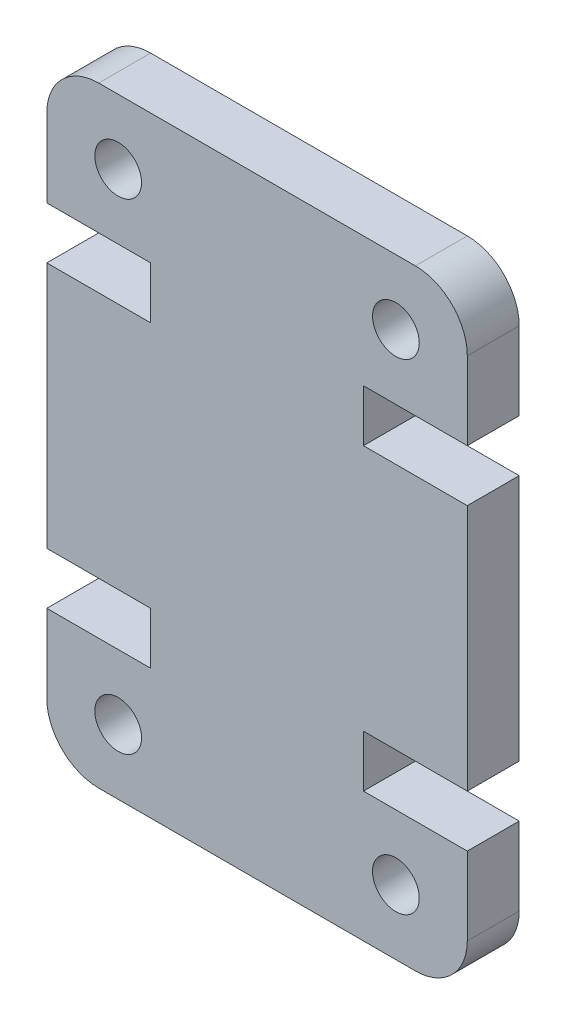
ISO-10303-21;
HEADER;
FILE_DESCRIPTION(('STEP AP214'),'2;1');
FILE_NAME('part.step','',(''),(''),'','','');
FILE_SCHEMA(('AUTOMOTIVE_DESIGN { 1 0 10303 214 1 1 1 1 }'));
ENDSEC;
DATA;
#1=APPLICATION_CONTEXT('core data for automotive mechanical design processes');
#2=APPLICATION_PROTOCOL_DEFINITION('international standard','automotive_design',2000,#1);
#3=PRODUCT_CONTEXT('',#1,'mechanical');
#4=PRODUCT('Part','Part','',(#3));
#5=PRODUCT_RELATED_PRODUCT_CATEGORY('part','',(#4));
#6=PRODUCT_DEFINITION_FORMATION('','',#4);
#7=PRODUCT_DEFINITION_CONTEXT('part definition',#1,'design');
#8=PRODUCT_DEFINITION('design','',#6,#7);
#9=PRODUCT_DEFINITION_SHAPE('','',#8);
#10=(LENGTH_UNIT() NAMED_UNIT(*) SI_UNIT(.MILLI.,.METRE.));
#11=(NAMED_UNIT(*) PLANE_ANGLE_UNIT() SI_UNIT($,.RADIAN.));
#12=(NAMED_UNIT(*) SI_UNIT($,.STERADIAN.) SOLID_ANGLE_UNIT());
#13=UNCERTAINTY_MEASURE_WITH_UNIT(LENGTH_MEASURE(1.E-05),#10,'distance_accuracy_value','');
#14=(GEOMETRIC_REPRESENTATION_CONTEXT(3) GLOBAL_UNCERTAINTY_ASSIGNED_CONTEXT((#13)) GLOBAL_UNIT_ASSIGNED_CONTEXT((#10,
#11,#12)) REPRESENTATION_CONTEXT('',''));
#15=CARTESIAN_POINT('',(0.,0.,0.));
#16=DIRECTION('',(0.,0.,1.));
#17=DIRECTION('',(1.,0.,0.));
#18=AXIS2_PLACEMENT_3D('',#15,#16,#17);
#19=CARTESIAN_POINT('',(14.2,2.,2.));
#20=DIRECTION('',(0.,0.,-1.));
#21=DIRECTION('',(-1.,0.,0.));
#22=AXIS2_PLACEMENT_3D('',#19,#20,#21);
#23=PLANE('',#22);
#24=CARTESIAN_POINT('',(13.4499999999986,21.0250000000001,2.));
#25=DIRECTION('',(0.,0.,1.));
#26=DIRECTION('',(1.,0.,0.));
#27=AXIS2_PLACEMENT_3D('',#24,#25,#26);
#28=CIRCLE('',#27,0.900000000000001);
#29=CARTESIAN_POINT('',(14.3499999999986,21.0250000000001,2.));
#30=VERTEX_POINT('',#29);
#31=EDGE_CURVE('E448',#30,#30,#28,.T.);
#32=ORIENTED_EDGE('',*,*,#31,.F.);
#33=EDGE_LOOP('',(#32));
#34=FACE_BOUND('',#33,.T.);
#35=CARTESIAN_POINT('',(13.4499999999986,2.4999999999999,2.));
#36=DIRECTION('',(0.,0.,1.));
#37=DIRECTION('',(-1.,0.,0.));
#38=AXIS2_PLACEMENT_3D('',#35,#36,#37);
#39=CIRCLE('',#38,0.9);
#40=CARTESIAN_POINT('',(12.5499999999986,2.4999999999999,2.));
#41=VERTEX_POINT('',#40);
#42=EDGE_CURVE('E230',#41,#41,#39,.T.);
#43=ORIENTED_EDGE('',*,*,#42,.F.);
#44=EDGE_LOOP('',(#43));
#45=FACE_BOUND('',#44,.T.);
#46=CARTESIAN_POINT('',(14.2,2.,2.));
#47=DIRECTION('',(0.,0.,1.));
#48=DIRECTION('',(-1.,0.,0.));
#49=AXIS2_PLACEMENT_3D('',#46,#47,#48);
#50=CIRCLE('',#49,2.);
#51=CARTESIAN_POINT('',(14.2,0.,2.));
#52=VERTEX_POINT('',#51);
#53=CARTESIAN_POINT('',(16.2,2.,2.));
#54=VERTEX_POINT('',#53);
#55=EDGE_CURVE('E273',#52,#54,#50,.T.);
#56=ORIENTED_EDGE('',*,*,#55,.T.);
#57=DIRECTION('',(0.,1.,0.));
#58=VECTOR('',#57,1.);
#59=CARTESIAN_POINT('',(16.2,5.00000000000014,2.));
#60=LINE('',#59,#58);
#61=CARTESIAN_POINT('',(16.2,5.00000000000014,2.));
#62=VERTEX_POINT('',#61);
#63=EDGE_CURVE('E141',#54,#62,#60,.T.);
#64=ORIENTED_EDGE('',*,*,#63,.T.);
#65=DIRECTION('',(-1.,0.,0.));
#66=VECTOR('',#65,1.);
#67=CARTESIAN_POINT('',(12.2,5.00000000000014,2.));
#68=LINE('',#67,#66);
#69=CARTESIAN_POINT('',(12.2,5.00000000000014,2.));
#70=VERTEX_POINT('',#69);
#71=EDGE_CURVE('E336',#62,#70,#68,.T.);
#72=ORIENTED_EDGE('',*,*,#71,.T.);
#73=DIRECTION('',(0.,1.,0.));
#74=VECTOR('',#73,1.);
#75=CARTESIAN_POINT('',(12.2,7.00000000000014,2.));
#76=LINE('',#75,#74);
#77=CARTESIAN_POINT('',(12.2,7.00000000000014,2.));
#78=VERTEX_POINT('',#77);
#79=EDGE_CURVE('E355',#70,#78,#76,.T.);
#80=ORIENTED_EDGE('',*,*,#79,.T.);
#81=DIRECTION('',(1.,0.,0.));
#82=VECTOR('',#81,1.);
#83=CARTESIAN_POINT('',(16.2,7.00000000000014,2.));
#84=LINE('',#83,#82);
#85=CARTESIAN_POINT('',(16.2,7.00000000000014,2.));
#86=VERTEX_POINT('',#85);
#87=EDGE_CURVE('E352',#78,#86,#84,.T.);
#88=ORIENTED_EDGE('',*,*,#87,.T.);
#89=DIRECTION('',(0.,1.,0.));
#90=VECTOR('',#89,1.);
#91=CARTESIAN_POINT('',(16.2,7.00000000000014,2.));
#92=LINE('',#91,#90);
#93=CARTESIAN_POINT('',(16.2,16.5249999999999,2.));
#94=VERTEX_POINT('',#93);
#95=EDGE_CURVE('E354',#86,#94,#92,.T.);
#96=ORIENTED_EDGE('',*,*,#95,.T.);
#97=DIRECTION('',(-1.,0.,0.));
#98=VECTOR('',#97,1.);
#99=CARTESIAN_POINT('',(16.2,16.5249999999999,2.));
#100=LINE('',#99,#98);
#101=CARTESIAN_POINT('',(12.2,16.5249999999999,2.));
#102=VERTEX_POINT('',#101);
#103=EDGE_CURVE('E357',#94,#102,#100,.T.);
#104=ORIENTED_EDGE('',*,*,#103,.T.);
#105=DIRECTION('',(0.,1.,0.));
#106=VECTOR('',#105,1.);
#107=CARTESIAN_POINT('',(12.2,16.5249999999999,2.));
#108=LINE('',#107,#106);
#109=CARTESIAN_POINT('',(12.2,18.5249999999999,2.));
#110=VERTEX_POINT('',#109);
#111=EDGE_CURVE('E363',#102,#110,#108,.T.);
#112=ORIENTED_EDGE('',*,*,#111,.T.);
#113=DIRECTION('',(1.,0.,0.));
#114=VECTOR('',#113,1.);
#115=CARTESIAN_POINT('',(12.2,18.5249999999999,2.));
#116=LINE('',#115,#114);
#117=CARTESIAN_POINT('',(16.2,18.5249999999999,2.));
#118=VERTEX_POINT('',#117);
#119=EDGE_CURVE('E365',#110,#118,#116,.T.);
#120=ORIENTED_EDGE('',*,*,#119,.T.);
#121=DIRECTION('',(0.,1.,0.));
#122=VECTOR('',#121,1.);
#123=CARTESIAN_POINT('',(16.2,18.5249999999999,2.));
#124=LINE('',#123,#122);
#125=CARTESIAN_POINT('',(16.2,21.525,2.));
#126=VERTEX_POINT('',#125);
#127=EDGE_CURVE('E367',#118,#126,#124,.T.);
#128=ORIENTED_EDGE('',*,*,#127,.T.);
#129=CARTESIAN_POINT('',(14.2,21.525,2.));
#130=DIRECTION('',(0.,0.,1.));
#131=DIRECTION('',(1.,0.,0.));
#132=AXIS2_PLACEMENT_3D('',#129,#130,#131);
#133=CIRCLE('',#132,2.);
#134=CARTESIAN_POINT('',(14.2,23.525,2.));
#135=VERTEX_POINT('',#134);
#136=EDGE_CURVE('E369',#126,#135,#133,.T.);
#137=ORIENTED_EDGE('',*,*,#136,.T.);
#138=DIRECTION('',(-1.,0.,0.));
#139=VECTOR('',#138,1.);
#140=CARTESIAN_POINT('',(1.99999999999999,23.525,2.));
#141=LINE('',#140,#139);
#142=CARTESIAN_POINT('',(1.99999999999999,23.525,2.));
#143=VERTEX_POINT('',#142);
#144=EDGE_CURVE('E371',#135,#143,#141,.T.);
#145=ORIENTED_EDGE('',*,*,#144,.T.);
#146=CARTESIAN_POINT('',(2.,21.525,2.));
#147=DIRECTION('',(0.,0.,1.));
#148=DIRECTION('',(-1.,0.,0.));
#149=AXIS2_PLACEMENT_3D('',#146,#147,#148);
#150=CIRCLE('',#149,2.);
#151=CARTESIAN_POINT('',(0.,21.525,2.));
#152=VERTEX_POINT('',#151);
#153=EDGE_CURVE('E373',#143,#152,#150,.T.);
#154=ORIENTED_EDGE('',*,*,#153,.T.);
#155=DIRECTION('',(0.,-1.,0.));
#156=VECTOR('',#155,1.);
#157=CARTESIAN_POINT('',(0.,18.5249999999999,2.));
#158=LINE('',#157,#156);
#159=CARTESIAN_POINT('',(0.,18.5249999999999,2.));
#160=VERTEX_POINT('',#159);
#161=EDGE_CURVE('E375',#152,#160,#158,.T.);
#162=ORIENTED_EDGE('',*,*,#161,.T.);
#163=DIRECTION('',(1.,0.,0.));
#164=VECTOR('',#163,1.);
#165=CARTESIAN_POINT('',(4.,18.5249999999999,2.));
#166=LINE('',#165,#164);
#167=CARTESIAN_POINT('',(4.,18.5249999999999,2.));
#168=VERTEX_POINT('',#167);
#169=EDGE_CURVE('E377',#160,#168,#166,.T.);
#170=ORIENTED_EDGE('',*,*,#169,.T.);
#171=DIRECTION('',(0.,-1.,0.));
#172=VECTOR('',#171,1.);
#173=CARTESIAN_POINT('',(4.,16.5249999999999,2.));
#174=LINE('',#173,#172);
#175=CARTESIAN_POINT('',(4.,16.5249999999999,2.));
#176=VERTEX_POINT('',#175);
#177=EDGE_CURVE('E379',#168,#176,#174,.T.);
#178=ORIENTED_EDGE('',*,*,#177,.T.);
#179=DIRECTION('',(-1.,0.,0.));
#180=VECTOR('',#179,1.);
#181=CARTESIAN_POINT('',(0.,16.5249999999999,2.));
#182=LINE('',#181,#180);
#183=CARTESIAN_POINT('',(0.,16.5249999999999,2.));
#184=VERTEX_POINT('',#183);
#185=EDGE_CURVE('E381',#176,#184,#182,.T.);
#186=ORIENTED_EDGE('',*,*,#185,.T.);
#187=DIRECTION('',(0.,-1.,0.));
#188=VECTOR('',#187,1.);
#189=CARTESIAN_POINT('',(0.,7.00000000000012,2.));
#190=LINE('',#189,#188);
#191=CARTESIAN_POINT('',(0.,7.00000000000012,2.));
#192=VERTEX_POINT('',#191);
#193=EDGE_CURVE('E383',#184,#192,#190,.T.);
#194=ORIENTED_EDGE('',*,*,#193,.T.);
#195=DIRECTION('',(1.,0.,0.));
#196=VECTOR('',#195,1.);
#197=CARTESIAN_POINT('',(0.,7.00000000000012,2.));
#198=LINE('',#197,#196);
#199=CARTESIAN_POINT('',(4.,7.00000000000014,2.));
#200=VERTEX_POINT('',#199);
#201=EDGE_CURVE('E385',#192,#200,#198,.T.);
#202=ORIENTED_EDGE('',*,*,#201,.T.);
#203=DIRECTION('',(0.,-1.,0.));
#204=VECTOR('',#203,1.);
#205=CARTESIAN_POINT('',(4.,7.00000000000014,2.));
#206=LINE('',#205,#204);
#207=CARTESIAN_POINT('',(4.,5.00000000000014,2.));
#208=VERTEX_POINT('',#207);
#209=EDGE_CURVE('E387',#200,#208,#206,.T.);
#210=ORIENTED_EDGE('',*,*,#209,.T.);
#211=DIRECTION('',(-1.,0.,0.));
#212=VECTOR('',#211,1.);
#213=CARTESIAN_POINT('',(4.,5.00000000000014,2.));
#214=LINE('',#213,#212);
#215=CARTESIAN_POINT('',(0.,5.00000000000014,2.));
#216=VERTEX_POINT('',#215);
#217=EDGE_CURVE('E208',#208,#216,#214,.T.);
#218=ORIENTED_EDGE('',*,*,#217,.T.);
#219=DIRECTION('',(0.,-1.,0.));
#220=VECTOR('',#219,1.);
#221=CARTESIAN_POINT('',(0.,5.00000000000014,2.));
#222=LINE('',#221,#220);
#223=CARTESIAN_POINT('',(0.,2.00000000000002,2.));
#224=VERTEX_POINT('',#223);
#225=EDGE_CURVE('E202',#216,#224,#222,.T.);
#226=ORIENTED_EDGE('',*,*,#225,.T.);
#227=CARTESIAN_POINT('',(2.,2.,2.));
#228=DIRECTION('',(0.,0.,1.));
#229=DIRECTION('',(1.,0.,0.));
#230=AXIS2_PLACEMENT_3D('',#227,#228,#229);
#231=CIRCLE('',#230,2.);
#232=CARTESIAN_POINT('',(2.,0.,2.));
#233=VERTEX_POINT('',#232);
#234=EDGE_CURVE('E206',#224,#233,#231,.T.);
#235=ORIENTED_EDGE('',*,*,#234,.T.);
#236=DIRECTION('',(1.,0.,0.));
#237=VECTOR('',#236,1.);
#238=CARTESIAN_POINT('',(2.,0.,2.));
#239=LINE('',#238,#237);
#240=EDGE_CURVE('E50',#233,#52,#239,.T.);
#241=ORIENTED_EDGE('',*,*,#240,.T.);
#242=EDGE_LOOP('',(#56,#64,#72,#80,#88,#96,#104,#112,#120,#128,#137,#145,#154,#162,#170,#178,
#186,#194,#202,#210,#218,#226,#235,#241));
#243=FACE_BOUND('',#242,.T.);
#244=CARTESIAN_POINT('',(2.75000000000137,21.0250000000001,2.));
#245=DIRECTION('',(0.,0.,1.));
#246=DIRECTION('',(-1.,0.,0.));
#247=AXIS2_PLACEMENT_3D('',#244,#245,#246);
#248=CIRCLE('',#247,0.9);
#249=CARTESIAN_POINT('',(1.85000000000137,21.0250000000001,2.));
#250=VERTEX_POINT('',#249);
#251=EDGE_CURVE('E454',#250,#250,#248,.T.);
#252=ORIENTED_EDGE('',*,*,#251,.F.);
#253=EDGE_LOOP('',(#252));
#254=FACE_BOUND('',#253,.T.);
#255=CARTESIAN_POINT('',(2.75000000000138,2.4999999999999,2.));
#256=DIRECTION('',(0.,0.,1.));
#257=DIRECTION('',(1.,0.,0.));
#258=AXIS2_PLACEMENT_3D('',#255,#256,#257);
#259=CIRCLE('',#258,0.9);
#260=CARTESIAN_POINT('',(3.65000000000138,2.4999999999999,2.));
#261=VERTEX_POINT('',#260);
#262=EDGE_CURVE('E439',#261,#261,#259,.T.);
#263=ORIENTED_EDGE('',*,*,#262,.F.);
#264=EDGE_LOOP('',(#263));
#265=FACE_BOUND('',#264,.T.);
#266=ADVANCED_FACE('F33',(#34,#45,#243,#254,#265),#23,.F.);
#267=CARTESIAN_POINT('',(14.2,2.,0.));
#268=DIRECTION('',(0.,0.,-1.));
#269=DIRECTION('',(-1.,0.,0.));
#270=AXIS2_PLACEMENT_3D('',#267,#268,#269);
#271=PLANE('',#270);
#272=CARTESIAN_POINT('',(13.4499999999986,21.0250000000001,0.));
#273=DIRECTION('',(0.,0.,1.));
#274=DIRECTION('',(1.,0.,0.));
#275=AXIS2_PLACEMENT_3D('',#272,#273,#274);
#276=CIRCLE('',#275,0.900000000000001);
#277=CARTESIAN_POINT('',(14.3499999999986,21.0250000000001,0.));
#278=VERTEX_POINT('',#277);
#279=EDGE_CURVE('E445',#278,#278,#276,.T.);
#280=ORIENTED_EDGE('',*,*,#279,.T.);
#281=EDGE_LOOP('',(#280));
#282=FACE_BOUND('',#281,.T.);
#283=CARTESIAN_POINT('',(13.4499999999986,2.4999999999999,0.));
#284=DIRECTION('',(0.,0.,1.));
#285=DIRECTION('',(-1.,0.,0.));
#286=AXIS2_PLACEMENT_3D('',#283,#284,#285);
#287=CIRCLE('',#286,0.9);
#288=CARTESIAN_POINT('',(12.5499999999986,2.4999999999999,0.));
#289=VERTEX_POINT('',#288);
#290=EDGE_CURVE('E457',#289,#289,#287,.T.);
#291=ORIENTED_EDGE('',*,*,#290,.T.);
#292=EDGE_LOOP('',(#291));
#293=FACE_BOUND('',#292,.T.);
#294=CARTESIAN_POINT('',(14.2,2.,0.));
#295=DIRECTION('',(0.,0.,1.));
#296=DIRECTION('',(-1.,0.,0.));
#297=AXIS2_PLACEMENT_3D('',#294,#295,#296);
#298=CIRCLE('',#297,2.);
#299=CARTESIAN_POINT('',(14.2,0.,0.));
#300=VERTEX_POINT('',#299);
#301=CARTESIAN_POINT('',(16.2,2.,0.));
#302=VERTEX_POINT('',#301);
#303=EDGE_CURVE('E226',#300,#302,#298,.T.);
#304=ORIENTED_EDGE('',*,*,#303,.F.);
#305=DIRECTION('',(1.,0.,0.));
#306=VECTOR('',#305,1.);
#307=CARTESIAN_POINT('',(2.,0.,0.));
#308=LINE('',#307,#306);
#309=CARTESIAN_POINT('',(2.,0.,0.));
#310=VERTEX_POINT('',#309);
#311=EDGE_CURVE('E133',#310,#300,#308,.T.);
#312=ORIENTED_EDGE('',*,*,#311,.F.);
#313=CARTESIAN_POINT('',(2.,2.,0.));
#314=DIRECTION('',(0.,0.,1.));
#315=DIRECTION('',(1.,0.,0.));
#316=AXIS2_PLACEMENT_3D('',#313,#314,#315);
#317=CIRCLE('',#316,2.);
#318=CARTESIAN_POINT('',(0.,2.00000000000002,0.));
#319=VERTEX_POINT('',#318);
#320=EDGE_CURVE('E127',#319,#310,#317,.T.);
#321=ORIENTED_EDGE('',*,*,#320,.F.);
#322=DIRECTION('',(0.,-1.,0.));
#323=VECTOR('',#322,1.);
#324=CARTESIAN_POINT('',(0.,5.00000000000014,0.));
#325=LINE('',#324,#323);
#326=CARTESIAN_POINT('',(0.,5.00000000000014,0.));
#327=VERTEX_POINT('',#326);
#328=EDGE_CURVE('E216',#327,#319,#325,.T.);
#329=ORIENTED_EDGE('',*,*,#328,.F.);
#330=DIRECTION('',(-1.,0.,0.));
#331=VECTOR('',#330,1.);
#332=CARTESIAN_POINT('',(4.,5.00000000000014,0.));
#333=LINE('',#332,#331);
#334=CARTESIAN_POINT('',(4.,5.00000000000014,0.));
#335=VERTEX_POINT('',#334);
#336=EDGE_CURVE('E268',#335,#327,#333,.T.);
#337=ORIENTED_EDGE('',*,*,#336,.F.);
#338=DIRECTION('',(0.,-1.,0.));
#339=VECTOR('',#338,1.);
#340=CARTESIAN_POINT('',(4.,7.00000000000014,0.));
#341=LINE('',#340,#339);
#342=CARTESIAN_POINT('',(4.,7.00000000000014,0.));
#343=VERTEX_POINT('',#342);
#344=EDGE_CURVE('E266',#343,#335,#341,.T.);
#345=ORIENTED_EDGE('',*,*,#344,.F.);
#346=DIRECTION('',(1.,0.,0.));
#347=VECTOR('',#346,1.);
#348=CARTESIAN_POINT('',(0.,7.00000000000012,0.));
#349=LINE('',#348,#347);
#350=CARTESIAN_POINT('',(0.,7.00000000000012,0.));
#351=VERTEX_POINT('',#350);
#352=EDGE_CURVE('E264',#351,#343,#349,.T.);
#353=ORIENTED_EDGE('',*,*,#352,.F.);
#354=DIRECTION('',(0.,-1.,0.));
#355=VECTOR('',#354,1.);
#356=CARTESIAN_POINT('',(0.,7.00000000000012,0.));
#357=LINE('',#356,#355);
#358=CARTESIAN_POINT('',(0.,16.5249999999999,0.));
#359=VERTEX_POINT('',#358);
#360=EDGE_CURVE('E262',#359,#351,#357,.T.);
#361=ORIENTED_EDGE('',*,*,#360,.F.);
#362=DIRECTION('',(-1.,0.,0.));
#363=VECTOR('',#362,1.);
#364=CARTESIAN_POINT('',(0.,16.5249999999999,0.));
#365=LINE('',#364,#363);
#366=CARTESIAN_POINT('',(4.,16.5249999999999,0.));
#367=VERTEX_POINT('',#366);
#368=EDGE_CURVE('E260',#367,#359,#365,.T.);
#369=ORIENTED_EDGE('',*,*,#368,.F.);
#370=DIRECTION('',(0.,-1.,0.));
#371=VECTOR('',#370,1.);
#372=CARTESIAN_POINT('',(4.,16.5249999999999,0.));
#373=LINE('',#372,#371);
#374=CARTESIAN_POINT('',(4.,18.5249999999999,0.));
#375=VERTEX_POINT('',#374);
#376=EDGE_CURVE('E258',#375,#367,#373,.T.);
#377=ORIENTED_EDGE('',*,*,#376,.F.);
#378=DIRECTION('',(1.,0.,0.));
#379=VECTOR('',#378,1.);
#380=CARTESIAN_POINT('',(4.,18.5249999999999,0.));
#381=LINE('',#380,#379);
#382=CARTESIAN_POINT('',(0.,18.5249999999999,0.));
#383=VERTEX_POINT('',#382);
#384=EDGE_CURVE('E256',#383,#375,#381,.T.);
#385=ORIENTED_EDGE('',*,*,#384,.F.);
#386=DIRECTION('',(0.,-1.,0.));
#387=VECTOR('',#386,1.);
#388=CARTESIAN_POINT('',(0.,18.5249999999999,0.));
#389=LINE('',#388,#387);
#390=CARTESIAN_POINT('',(0.,21.525,0.));
#391=VERTEX_POINT('',#390);
#392=EDGE_CURVE('E254',#391,#383,#389,.T.);
#393=ORIENTED_EDGE('',*,*,#392,.F.);
#394=CARTESIAN_POINT('',(2.,21.525,0.));
#395=DIRECTION('',(0.,0.,1.));
#396=DIRECTION('',(-1.,0.,0.));
#397=AXIS2_PLACEMENT_3D('',#394,#395,#396);
#398=CIRCLE('',#397,2.);
#399=CARTESIAN_POINT('',(1.99999999999999,23.525,0.));
#400=VERTEX_POINT('',#399);
#401=EDGE_CURVE('E252',#400,#391,#398,.T.);
#402=ORIENTED_EDGE('',*,*,#401,.F.);
#403=DIRECTION('',(-1.,0.,0.));
#404=VECTOR('',#403,1.);
#405=CARTESIAN_POINT('',(1.99999999999999,23.525,0.));
#406=LINE('',#405,#404);
#407=CARTESIAN_POINT('',(14.2,23.525,0.));
#408=VERTEX_POINT('',#407);
#409=EDGE_CURVE('E250',#408,#400,#406,.T.);
#410=ORIENTED_EDGE('',*,*,#409,.F.);
#411=CARTESIAN_POINT('',(14.2,21.525,0.));
#412=DIRECTION('',(0.,0.,1.));
#413=DIRECTION('',(1.,0.,0.));
#414=AXIS2_PLACEMENT_3D('',#411,#412,#413);
#415=CIRCLE('',#414,2.);
#416=CARTESIAN_POINT('',(16.2,21.525,0.));
#417=VERTEX_POINT('',#416);
#418=EDGE_CURVE('E248',#417,#408,#415,.T.);
#419=ORIENTED_EDGE('',*,*,#418,.F.);
#420=DIRECTION('',(0.,1.,0.));
#421=VECTOR('',#420,1.);
#422=CARTESIAN_POINT('',(16.2,18.5249999999999,0.));
#423=LINE('',#422,#421);
#424=CARTESIAN_POINT('',(16.2,18.5249999999999,0.));
#425=VERTEX_POINT('',#424);
#426=EDGE_CURVE('E246',#425,#417,#423,.T.);
#427=ORIENTED_EDGE('',*,*,#426,.F.);
#428=DIRECTION('',(1.,0.,0.));
#429=VECTOR('',#428,1.);
#430=CARTESIAN_POINT('',(12.2,18.5249999999999,0.));
#431=LINE('',#430,#429);
#432=CARTESIAN_POINT('',(12.2,18.5249999999999,0.));
#433=VERTEX_POINT('',#432);
#434=EDGE_CURVE('E244',#433,#425,#431,.T.);
#435=ORIENTED_EDGE('',*,*,#434,.F.);
#436=DIRECTION('',(0.,1.,0.));
#437=VECTOR('',#436,1.);
#438=CARTESIAN_POINT('',(12.2,16.5249999999999,0.));
#439=LINE('',#438,#437);
#440=CARTESIAN_POINT('',(12.2,16.5249999999999,0.));
#441=VERTEX_POINT('',#440);
#442=EDGE_CURVE('E242',#441,#433,#439,.T.);
#443=ORIENTED_EDGE('',*,*,#442,.F.);
#444=DIRECTION('',(-1.,0.,0.));
#445=VECTOR('',#444,1.);
#446=CARTESIAN_POINT('',(16.2,16.5249999999999,0.));
#447=LINE('',#446,#445);
#448=CARTESIAN_POINT('',(16.2,16.5249999999999,0.));
#449=VERTEX_POINT('',#448);
#450=EDGE_CURVE('E240',#449,#441,#447,.T.);
#451=ORIENTED_EDGE('',*,*,#450,.F.);
#452=DIRECTION('',(0.,1.,0.));
#453=VECTOR('',#452,1.);
#454=CARTESIAN_POINT('',(16.2,7.00000000000014,0.));
#455=LINE('',#454,#453);
#456=CARTESIAN_POINT('',(16.2,7.00000000000014,0.));
#457=VERTEX_POINT('',#456);
#458=EDGE_CURVE('E238',#457,#449,#455,.T.);
#459=ORIENTED_EDGE('',*,*,#458,.F.);
#460=DIRECTION('',(1.,0.,0.));
#461=VECTOR('',#460,1.);
#462=CARTESIAN_POINT('',(16.2,7.00000000000014,0.));
#463=LINE('',#462,#461);
#464=CARTESIAN_POINT('',(12.2,7.00000000000014,0.));
#465=VERTEX_POINT('',#464);
#466=EDGE_CURVE('E236',#465,#457,#463,.T.);
#467=ORIENTED_EDGE('',*,*,#466,.F.);
#468=DIRECTION('',(0.,1.,0.));
#469=VECTOR('',#468,1.);
#470=CARTESIAN_POINT('',(12.2,7.00000000000014,0.));
#471=LINE('',#470,#469);
#472=CARTESIAN_POINT('',(12.2,5.00000000000014,0.));
#473=VERTEX_POINT('',#472);
#474=EDGE_CURVE('E234',#473,#465,#471,.T.);
#475=ORIENTED_EDGE('',*,*,#474,.F.);
#476=DIRECTION('',(-1.,0.,0.));
#477=VECTOR('',#476,1.);
#478=CARTESIAN_POINT('',(12.2,5.00000000000014,0.));
#479=LINE('',#478,#477);
#480=CARTESIAN_POINT('',(16.2,5.00000000000014,0.));
#481=VERTEX_POINT('',#480);
#482=EDGE_CURVE('E232',#481,#473,#479,.T.);
#483=ORIENTED_EDGE('',*,*,#482,.F.);
#484=DIRECTION('',(0.,1.,0.));
#485=VECTOR('',#484,1.);
#486=CARTESIAN_POINT('',(16.2,5.00000000000014,0.));
#487=LINE('',#486,#485);
#488=EDGE_CURVE('E229',#302,#481,#487,.T.);
#489=ORIENTED_EDGE('',*,*,#488,.F.);
#490=EDGE_LOOP('',(#304,#312,#321,#329,#337,#345,#353,#361,#369,#377,#385,#393,#402,#410,#419,
#427,#435,#443,#451,#459,#467,#475,#483,#489));
#491=FACE_BOUND('',#490,.T.);
#492=CARTESIAN_POINT('',(2.75000000000137,21.0250000000001,0.));
#493=DIRECTION('',(0.,0.,1.));
#494=DIRECTION('',(-1.,0.,0.));
#495=AXIS2_PLACEMENT_3D('',#492,#493,#494);
#496=CIRCLE('',#495,0.9);
#497=CARTESIAN_POINT('',(1.85000000000137,21.0250000000001,0.));
#498=VERTEX_POINT('',#497);
#499=EDGE_CURVE('E451',#498,#498,#496,.T.);
#500=ORIENTED_EDGE('',*,*,#499,.T.);
#501=EDGE_LOOP('',(#500));
#502=FACE_BOUND('',#501,.T.);
#503=CARTESIAN_POINT('',(2.75000000000138,2.4999999999999,0.));
#504=DIRECTION('',(0.,0.,1.));
#505=DIRECTION('',(1.,0.,0.));
#506=AXIS2_PLACEMENT_3D('',#503,#504,#505);
#507=CIRCLE('',#506,0.9);
#508=CARTESIAN_POINT('',(3.65000000000138,2.4999999999999,0.));
#509=VERTEX_POINT('',#508);
#510=EDGE_CURVE('E442',#509,#509,#507,.T.);
#511=ORIENTED_EDGE('',*,*,#510,.T.);
#512=EDGE_LOOP('',(#511));
#513=FACE_BOUND('',#512,.T.);
#514=ADVANCED_FACE('F340',(#282,#293,#491,#502,#513),#271,.T.);
#515=CARTESIAN_POINT('',(14.2,2.,2.));
#516=DIRECTION('',(0.,0.,-1.));
#517=DIRECTION('',(-1.,0.,0.));
#518=AXIS2_PLACEMENT_3D('',#515,#516,#517);
#519=CYLINDRICAL_SURFACE('',#518,2.);
#520=ORIENTED_EDGE('',*,*,#303,.T.);
#521=DIRECTION('',(0.,0.,-1.));
#522=VECTOR('',#521,1.);
#523=CARTESIAN_POINT('',(16.2,2.,2.));
#524=LINE('',#523,#522);
#525=EDGE_CURVE('E11',#54,#302,#524,.T.);
#526=ORIENTED_EDGE('',*,*,#525,.F.);
#527=ORIENTED_EDGE('',*,*,#55,.F.);
#528=DIRECTION('',(0.,0.,-1.));
#529=VECTOR('',#528,1.);
#530=CARTESIAN_POINT('',(14.2,0.,2.));
#531=LINE('',#530,#529);
#532=EDGE_CURVE('E222',#52,#300,#531,.T.);
#533=ORIENTED_EDGE('',*,*,#532,.T.);
#534=EDGE_LOOP('',(#520,#526,#527,#533));
#535=FACE_BOUND('',#534,.T.);
#536=ADVANCED_FACE('F35',(#535),#519,.T.);
#537=CARTESIAN_POINT('',(16.2,5.00000000000014,2.));
#538=DIRECTION('',(-1.,0.,0.));
#539=DIRECTION('',(0.,-1.,0.));
#540=AXIS2_PLACEMENT_3D('',#537,#538,#539);
#541=PLANE('',#540);
#542=ORIENTED_EDGE('',*,*,#488,.T.);
#543=DIRECTION('',(0.,0.,-1.));
#544=VECTOR('',#543,1.);
#545=CARTESIAN_POINT('',(16.2,5.00000000000014,2.));
#546=LINE('',#545,#544);
#547=EDGE_CURVE('E42',#62,#481,#546,.T.);
#548=ORIENTED_EDGE('',*,*,#547,.F.);
#549=ORIENTED_EDGE('',*,*,#63,.F.);
#550=ORIENTED_EDGE('',*,*,#525,.T.);
#551=EDGE_LOOP('',(#542,#548,#549,#550));
#552=FACE_BOUND('',#551,.T.);
#553=ADVANCED_FACE('F686',(#552),#541,.F.);
#554=CARTESIAN_POINT('',(12.2,5.00000000000014,2.));
#555=DIRECTION('',(0.,-1.,0.));
#556=DIRECTION('',(0.,0.,-1.));
#557=AXIS2_PLACEMENT_3D('',#554,#555,#556);
#558=PLANE('',#557);
#559=ORIENTED_EDGE('',*,*,#482,.T.);
#560=DIRECTION('',(0.,0.,-1.));
#561=VECTOR('',#560,1.);
#562=CARTESIAN_POINT('',(12.2,5.00000000000014,2.));
#563=LINE('',#562,#561);
#564=EDGE_CURVE('E328',#70,#473,#563,.T.);
#565=ORIENTED_EDGE('',*,*,#564,.F.);
#566=ORIENTED_EDGE('',*,*,#71,.F.);
#567=ORIENTED_EDGE('',*,*,#547,.T.);
#568=EDGE_LOOP('',(#559,#565,#566,#567));
#569=FACE_BOUND('',#568,.T.);
#570=ADVANCED_FACE('F334',(#569),#558,.F.);
#571=CARTESIAN_POINT('',(12.2,7.00000000000014,2.));
#572=DIRECTION('',(-1.,0.,0.));
#573=DIRECTION('',(0.,0.,1.));
#574=AXIS2_PLACEMENT_3D('',#571,#572,#573);
#575=PLANE('',#574);
#576=ORIENTED_EDGE('',*,*,#474,.T.);
#577=DIRECTION('',(0.,0.,-1.));
#578=VECTOR('',#577,1.);
#579=CARTESIAN_POINT('',(12.2,7.00000000000014,2.));
#580=LINE('',#579,#578);
#581=EDGE_CURVE('E325',#78,#465,#580,.T.);
#582=ORIENTED_EDGE('',*,*,#581,.F.);
#583=ORIENTED_EDGE('',*,*,#79,.F.);
#584=ORIENTED_EDGE('',*,*,#564,.T.);
#585=EDGE_LOOP('',(#576,#582,#583,#584));
#586=FACE_BOUND('',#585,.T.);
#587=ADVANCED_FACE('F346',(#586),#575,.F.);
#588=CARTESIAN_POINT('',(16.2,7.00000000000014,2.));
#589=DIRECTION('',(0.,1.,0.));
#590=DIRECTION('',(-1.,0.,0.));
#591=AXIS2_PLACEMENT_3D('',#588,#589,#590);
#592=PLANE('',#591);
#593=ORIENTED_EDGE('',*,*,#466,.T.);
#594=DIRECTION('',(0.,0.,-1.));
#595=VECTOR('',#594,1.);
#596=CARTESIAN_POINT('',(16.2,7.00000000000014,2.));
#597=LINE('',#596,#595);
#598=EDGE_CURVE('E322',#86,#457,#597,.T.);
#599=ORIENTED_EDGE('',*,*,#598,.F.);
#600=ORIENTED_EDGE('',*,*,#87,.F.);
#601=ORIENTED_EDGE('',*,*,#581,.T.);
#602=EDGE_LOOP('',(#593,#599,#600,#601));
#603=FACE_BOUND('',#602,.T.);
#604=ADVANCED_FACE('F350',(#603),#592,.F.);
#605=CARTESIAN_POINT('',(16.2,7.00000000000014,2.));
#606=DIRECTION('',(-1.,0.,0.));
#607=DIRECTION('',(0.,0.,1.));
#608=AXIS2_PLACEMENT_3D('',#605,#606,#607);
#609=PLANE('',#608);
#610=ORIENTED_EDGE('',*,*,#458,.T.);
#611=DIRECTION('',(0.,0.,-1.));
#612=VECTOR('',#611,1.);
#613=CARTESIAN_POINT('',(16.2,16.5249999999999,2.));
#614=LINE('',#613,#612);
#615=EDGE_CURVE('E319',#94,#449,#614,.T.);
#616=ORIENTED_EDGE('',*,*,#615,.F.);
#617=ORIENTED_EDGE('',*,*,#95,.F.);
#618=ORIENTED_EDGE('',*,*,#598,.T.);
#619=EDGE_LOOP('',(#610,#616,#617,#618));
#620=FACE_BOUND('',#619,.T.);
#621=ADVANCED_FACE('F651',(#620),#609,.F.);
#622=CARTESIAN_POINT('',(16.2,16.5249999999999,2.));
#623=DIRECTION('',(0.,-1.,0.));
#624=DIRECTION('',(1.,0.,0.));
#625=AXIS2_PLACEMENT_3D('',#622,#623,#624);
#626=PLANE('',#625);
#627=ORIENTED_EDGE('',*,*,#450,.T.);
#628=DIRECTION('',(0.,0.,-1.));
#629=VECTOR('',#628,1.);
#630=CARTESIAN_POINT('',(12.2,16.5249999999999,2.));
#631=LINE('',#630,#629);
#632=EDGE_CURVE('E316',#102,#441,#631,.T.);
#633=ORIENTED_EDGE('',*,*,#632,.F.);
#634=ORIENTED_EDGE('',*,*,#103,.F.);
#635=ORIENTED_EDGE('',*,*,#615,.T.);
#636=EDGE_LOOP('',(#627,#633,#634,#635));
#637=FACE_BOUND('',#636,.T.);
#638=ADVANCED_FACE('F641',(#637),#626,.F.);
#639=CARTESIAN_POINT('',(12.2,16.5249999999999,2.));
#640=DIRECTION('',(-1.,0.,0.));
#641=DIRECTION('',(0.,0.,1.));
#642=AXIS2_PLACEMENT_3D('',#639,#640,#641);
#643=PLANE('',#642);
#644=ORIENTED_EDGE('',*,*,#442,.T.);
#645=DIRECTION('',(0.,0.,-1.));
#646=VECTOR('',#645,1.);
#647=CARTESIAN_POINT('',(12.2,18.5249999999999,2.));
#648=LINE('',#647,#646);
#649=EDGE_CURVE('E313',#110,#433,#648,.T.);
#650=ORIENTED_EDGE('',*,*,#649,.F.);
#651=ORIENTED_EDGE('',*,*,#111,.F.);
#652=ORIENTED_EDGE('',*,*,#632,.T.);
#653=EDGE_LOOP('',(#644,#650,#651,#652));
#654=FACE_BOUND('',#653,.T.);
#655=ADVANCED_FACE('F631',(#654),#643,.F.);
#656=CARTESIAN_POINT('',(12.2,18.5249999999999,2.));
#657=DIRECTION('',(0.,1.,0.));
#658=DIRECTION('',(0.,0.,1.));
#659=AXIS2_PLACEMENT_3D('',#656,#657,#658);
#660=PLANE('',#659);
#661=ORIENTED_EDGE('',*,*,#434,.T.);
#662=DIRECTION('',(0.,0.,-1.));
#663=VECTOR('',#662,1.);
#664=CARTESIAN_POINT('',(16.2,18.5249999999999,2.));
#665=LINE('',#664,#663);
#666=EDGE_CURVE('E310',#118,#425,#665,.T.);
#667=ORIENTED_EDGE('',*,*,#666,.F.);
#668=ORIENTED_EDGE('',*,*,#119,.F.);
#669=ORIENTED_EDGE('',*,*,#649,.T.);
#670=EDGE_LOOP('',(#661,#667,#668,#669));
#671=FACE_BOUND('',#670,.T.);
#672=ADVANCED_FACE('F621',(#671),#660,.F.);
#673=CARTESIAN_POINT('',(16.2,18.5249999999999,2.));
#674=DIRECTION('',(-1.,0.,0.));
#675=DIRECTION('',(0.,-1.,0.));
#676=AXIS2_PLACEMENT_3D('',#673,#674,#675);
#677=PLANE('',#676);
#678=ORIENTED_EDGE('',*,*,#426,.T.);
#679=DIRECTION('',(0.,0.,-1.));
#680=VECTOR('',#679,1.);
#681=CARTESIAN_POINT('',(16.2,21.525,2.));
#682=LINE('',#681,#680);
#683=EDGE_CURVE('E307',#126,#417,#682,.T.);
#684=ORIENTED_EDGE('',*,*,#683,.F.);
#685=ORIENTED_EDGE('',*,*,#127,.F.);
#686=ORIENTED_EDGE('',*,*,#666,.T.);
#687=EDGE_LOOP('',(#678,#684,#685,#686));
#688=FACE_BOUND('',#687,.T.);
#689=ADVANCED_FACE('F611',(#688),#677,.F.);
#690=CARTESIAN_POINT('',(14.2,21.525,2.));
#691=DIRECTION('',(0.,0.,-1.));
#692=DIRECTION('',(-1.,0.,0.));
#693=AXIS2_PLACEMENT_3D('',#690,#691,#692);
#694=CYLINDRICAL_SURFACE('',#693,2.);
#695=ORIENTED_EDGE('',*,*,#418,.T.);
#696=DIRECTION('',(0.,0.,-1.));
#697=VECTOR('',#696,1.);
#698=CARTESIAN_POINT('',(14.2,23.525,2.));
#699=LINE('',#698,#697);
#700=EDGE_CURVE('E304',#135,#408,#699,.T.);
#701=ORIENTED_EDGE('',*,*,#700,.F.);
#702=ORIENTED_EDGE('',*,*,#136,.F.);
#703=ORIENTED_EDGE('',*,*,#683,.T.);
#704=EDGE_LOOP('',(#695,#701,#702,#703));
#705=FACE_BOUND('',#704,.T.);
#706=ADVANCED_FACE('F601',(#705),#694,.T.);
#707=CARTESIAN_POINT('',(1.99999999999999,23.525,2.));
#708=DIRECTION('',(0.,-1.,0.));
#709=DIRECTION('',(0.,0.,-1.));
#710=AXIS2_PLACEMENT_3D('',#707,#708,#709);
#711=PLANE('',#710);
#712=ORIENTED_EDGE('',*,*,#409,.T.);
#713=DIRECTION('',(0.,0.,-1.));
#714=VECTOR('',#713,1.);
#715=CARTESIAN_POINT('',(1.99999999999999,23.525,2.));
#716=LINE('',#715,#714);
#717=EDGE_CURVE('E301',#143,#400,#716,.T.);
#718=ORIENTED_EDGE('',*,*,#717,.F.);
#719=ORIENTED_EDGE('',*,*,#144,.F.);
#720=ORIENTED_EDGE('',*,*,#700,.T.);
#721=EDGE_LOOP('',(#712,#718,#719,#720));
#722=FACE_BOUND('',#721,.T.);
#723=ADVANCED_FACE('F591',(#722),#711,.F.);
#724=CARTESIAN_POINT('',(2.,21.525,2.));
#725=DIRECTION('',(0.,0.,-1.));
#726=DIRECTION('',(-1.,0.,0.));
#727=AXIS2_PLACEMENT_3D('',#724,#725,#726);
#728=CYLINDRICAL_SURFACE('',#727,2.);
#729=ORIENTED_EDGE('',*,*,#401,.T.);
#730=DIRECTION('',(0.,0.,-1.));
#731=VECTOR('',#730,1.);
#732=CARTESIAN_POINT('',(0.,21.525,2.));
#733=LINE('',#732,#731);
#734=EDGE_CURVE('E298',#152,#391,#733,.T.);
#735=ORIENTED_EDGE('',*,*,#734,.F.);
#736=ORIENTED_EDGE('',*,*,#153,.F.);
#737=ORIENTED_EDGE('',*,*,#717,.T.);
#738=EDGE_LOOP('',(#729,#735,#736,#737));
#739=FACE_BOUND('',#738,.T.);
#740=ADVANCED_FACE('F581',(#739),#728,.T.);
#741=CARTESIAN_POINT('',(0.,18.5249999999999,2.));
#742=DIRECTION('',(1.,0.,0.));
#743=DIRECTION('',(0.,1.,0.));
#744=AXIS2_PLACEMENT_3D('',#741,#742,#743);
#745=PLANE('',#744);
#746=ORIENTED_EDGE('',*,*,#392,.T.);
#747=DIRECTION('',(0.,0.,-1.));
#748=VECTOR('',#747,1.);
#749=CARTESIAN_POINT('',(0.,18.5249999999999,2.));
#750=LINE('',#749,#748);
#751=EDGE_CURVE('E295',#160,#383,#750,.T.);
#752=ORIENTED_EDGE('',*,*,#751,.F.);
#753=ORIENTED_EDGE('',*,*,#161,.F.);
#754=ORIENTED_EDGE('',*,*,#734,.T.);
#755=EDGE_LOOP('',(#746,#752,#753,#754));
#756=FACE_BOUND('',#755,.T.);
#757=ADVANCED_FACE('F571',(#756),#745,.F.);
#758=CARTESIAN_POINT('',(4.,18.5249999999999,2.));
#759=DIRECTION('',(0.,1.,0.));
#760=DIRECTION('',(-1.,0.,0.));
#761=AXIS2_PLACEMENT_3D('',#758,#759,#760);
#762=PLANE('',#761);
#763=ORIENTED_EDGE('',*,*,#384,.T.);
#764=DIRECTION('',(0.,0.,-1.));
#765=VECTOR('',#764,1.);
#766=CARTESIAN_POINT('',(4.,18.5249999999999,2.));
#767=LINE('',#766,#765);
#768=EDGE_CURVE('E292',#168,#375,#767,.T.);
#769=ORIENTED_EDGE('',*,*,#768,.F.);
#770=ORIENTED_EDGE('',*,*,#169,.F.);
#771=ORIENTED_EDGE('',*,*,#751,.T.);
#772=EDGE_LOOP('',(#763,#769,#770,#771));
#773=FACE_BOUND('',#772,.T.);
#774=ADVANCED_FACE('F561',(#773),#762,.F.);
#775=CARTESIAN_POINT('',(4.,16.5249999999999,2.));
#776=DIRECTION('',(1.,0.,0.));
#777=DIRECTION('',(0.,0.,-1.));
#778=AXIS2_PLACEMENT_3D('',#775,#776,#777);
#779=PLANE('',#778);
#780=ORIENTED_EDGE('',*,*,#376,.T.);
#781=DIRECTION('',(0.,0.,-1.));
#782=VECTOR('',#781,1.);
#783=CARTESIAN_POINT('',(4.,16.5249999999999,2.));
#784=LINE('',#783,#782);
#785=EDGE_CURVE('E289',#176,#367,#784,.T.);
#786=ORIENTED_EDGE('',*,*,#785,.F.);
#787=ORIENTED_EDGE('',*,*,#177,.F.);
#788=ORIENTED_EDGE('',*,*,#768,.T.);
#789=EDGE_LOOP('',(#780,#786,#787,#788));
#790=FACE_BOUND('',#789,.T.);
#791=ADVANCED_FACE('F551',(#790),#779,.F.);
#792=CARTESIAN_POINT('',(0.,16.5249999999999,2.));
#793=DIRECTION('',(0.,-1.,0.));
#794=DIRECTION('',(1.,0.,0.));
#795=AXIS2_PLACEMENT_3D('',#792,#793,#794);
#796=PLANE('',#795);
#797=ORIENTED_EDGE('',*,*,#368,.T.);
#798=DIRECTION('',(0.,0.,-1.));
#799=VECTOR('',#798,1.);
#800=CARTESIAN_POINT('',(0.,16.5249999999999,2.));
#801=LINE('',#800,#799);
#802=EDGE_CURVE('E286',#184,#359,#801,.T.);
#803=ORIENTED_EDGE('',*,*,#802,.F.);
#804=ORIENTED_EDGE('',*,*,#185,.F.);
#805=ORIENTED_EDGE('',*,*,#785,.T.);
#806=EDGE_LOOP('',(#797,#803,#804,#805));
#807=FACE_BOUND('',#806,.T.);
#808=ADVANCED_FACE('F541',(#807),#796,.F.);
#809=CARTESIAN_POINT('',(0.,7.00000000000012,2.));
#810=DIRECTION('',(1.,0.,0.));
#811=DIRECTION('',(0.,0.,-1.));
#812=AXIS2_PLACEMENT_3D('',#809,#810,#811);
#813=PLANE('',#812);
#814=ORIENTED_EDGE('',*,*,#360,.T.);
#815=DIRECTION('',(0.,0.,-1.));
#816=VECTOR('',#815,1.);
#817=CARTESIAN_POINT('',(0.,7.00000000000012,2.));
#818=LINE('',#817,#816);
#819=EDGE_CURVE('E283',#192,#351,#818,.T.);
#820=ORIENTED_EDGE('',*,*,#819,.F.);
#821=ORIENTED_EDGE('',*,*,#193,.F.);
#822=ORIENTED_EDGE('',*,*,#802,.T.);
#823=EDGE_LOOP('',(#814,#820,#821,#822));
#824=FACE_BOUND('',#823,.T.);
#825=ADVANCED_FACE('F531',(#824),#813,.F.);
#826=CARTESIAN_POINT('',(0.,7.00000000000012,2.));
#827=DIRECTION('',(0.,1.,0.));
#828=DIRECTION('',(-1.,0.,0.));
#829=AXIS2_PLACEMENT_3D('',#826,#827,#828);
#830=PLANE('',#829);
#831=ORIENTED_EDGE('',*,*,#352,.T.);
#832=DIRECTION('',(0.,0.,-1.));
#833=VECTOR('',#832,1.);
#834=CARTESIAN_POINT('',(4.,7.00000000000014,2.));
#835=LINE('',#834,#833);
#836=EDGE_CURVE('E280',#200,#343,#835,.T.);
#837=ORIENTED_EDGE('',*,*,#836,.F.);
#838=ORIENTED_EDGE('',*,*,#201,.F.);
#839=ORIENTED_EDGE('',*,*,#819,.T.);
#840=EDGE_LOOP('',(#831,#837,#838,#839));
#841=FACE_BOUND('',#840,.T.);
#842=ADVANCED_FACE('F522',(#841),#830,.F.);
#843=CARTESIAN_POINT('',(4.,7.00000000000014,2.));
#844=DIRECTION('',(1.,0.,0.));
#845=DIRECTION('',(0.,0.,-1.));
#846=AXIS2_PLACEMENT_3D('',#843,#844,#845);
#847=PLANE('',#846);
#848=ORIENTED_EDGE('',*,*,#344,.T.);
#849=DIRECTION('',(0.,0.,-1.));
#850=VECTOR('',#849,1.);
#851=CARTESIAN_POINT('',(4.,5.00000000000014,2.));
#852=LINE('',#851,#850);
#853=EDGE_CURVE('E277',#208,#335,#852,.T.);
#854=ORIENTED_EDGE('',*,*,#853,.F.);
#855=ORIENTED_EDGE('',*,*,#209,.F.);
#856=ORIENTED_EDGE('',*,*,#836,.T.);
#857=EDGE_LOOP('',(#848,#854,#855,#856));
#858=FACE_BOUND('',#857,.T.);
#859=ADVANCED_FACE('F393',(#858),#847,.F.);
#860=CARTESIAN_POINT('',(4.,5.00000000000014,2.));
#861=DIRECTION('',(0.,-1.,0.));
#862=DIRECTION('',(1.,0.,0.));
#863=AXIS2_PLACEMENT_3D('',#860,#861,#862);
#864=PLANE('',#863);
#865=ORIENTED_EDGE('',*,*,#336,.T.);
#866=DIRECTION('',(0.,0.,-1.));
#867=VECTOR('',#866,1.);
#868=CARTESIAN_POINT('',(0.,5.00000000000014,2.));
#869=LINE('',#868,#867);
#870=EDGE_CURVE('E217',#216,#327,#869,.T.);
#871=ORIENTED_EDGE('',*,*,#870,.F.);
#872=ORIENTED_EDGE('',*,*,#217,.F.);
#873=ORIENTED_EDGE('',*,*,#853,.T.);
#874=EDGE_LOOP('',(#865,#871,#872,#873));
#875=FACE_BOUND('',#874,.T.);
#876=ADVANCED_FACE('F397',(#875),#864,.F.);
#877=CARTESIAN_POINT('',(0.,5.00000000000014,2.));
#878=DIRECTION('',(1.,0.,0.));
#879=DIRECTION('',(0.,0.,-1.));
#880=AXIS2_PLACEMENT_3D('',#877,#878,#879);
#881=PLANE('',#880);
#882=ORIENTED_EDGE('',*,*,#328,.T.);
#883=DIRECTION('',(0.,0.,-1.));
#884=VECTOR('',#883,1.);
#885=CARTESIAN_POINT('',(0.,2.00000000000002,2.));
#886=LINE('',#885,#884);
#887=EDGE_CURVE('E213',#224,#319,#886,.T.);
#888=ORIENTED_EDGE('',*,*,#887,.F.);
#889=ORIENTED_EDGE('',*,*,#225,.F.);
#890=ORIENTED_EDGE('',*,*,#870,.T.);
#891=EDGE_LOOP('',(#882,#888,#889,#890));
#892=FACE_BOUND('',#891,.T.);
#893=ADVANCED_FACE('F214',(#892),#881,.F.);
#894=CARTESIAN_POINT('',(2.,2.,2.));
#895=DIRECTION('',(0.,0.,-1.));
#896=DIRECTION('',(-1.,0.,0.));
#897=AXIS2_PLACEMENT_3D('',#894,#895,#896);
#898=CYLINDRICAL_SURFACE('',#897,2.);
#899=ORIENTED_EDGE('',*,*,#320,.T.);
#900=DIRECTION('',(0.,0.,-1.));
#901=VECTOR('',#900,1.);
#902=CARTESIAN_POINT('',(2.,0.,2.));
#903=LINE('',#902,#901);
#904=EDGE_CURVE('E218',#233,#310,#903,.T.);
#905=ORIENTED_EDGE('',*,*,#904,.F.);
#906=ORIENTED_EDGE('',*,*,#234,.F.);
#907=ORIENTED_EDGE('',*,*,#887,.T.);
#908=EDGE_LOOP('',(#899,#905,#906,#907));
#909=FACE_BOUND('',#908,.T.);
#910=ADVANCED_FACE('F220',(#909),#898,.T.);
#911=CARTESIAN_POINT('',(2.,0.,2.));
#912=DIRECTION('',(0.,1.,0.));
#913=DIRECTION('',(-1.,0.,0.));
#914=AXIS2_PLACEMENT_3D('',#911,#912,#913);
#915=PLANE('',#914);
#916=ORIENTED_EDGE('',*,*,#311,.T.);
#917=ORIENTED_EDGE('',*,*,#532,.F.);
#918=ORIENTED_EDGE('',*,*,#240,.F.);
#919=ORIENTED_EDGE('',*,*,#904,.T.);
#920=EDGE_LOOP('',(#916,#917,#918,#919));
#921=FACE_BOUND('',#920,.T.);
#922=ADVANCED_FACE('F401',(#921),#915,.F.);
#923=CARTESIAN_POINT('',(13.4499999999986,2.4999999999999,2.));
#924=DIRECTION('',(0.,0.,-1.));
#925=DIRECTION('',(-1.,0.,0.));
#926=AXIS2_PLACEMENT_3D('',#923,#924,#925);
#927=CYLINDRICAL_SURFACE('',#926,0.9);
#928=ORIENTED_EDGE('',*,*,#42,.T.);
#929=EDGE_LOOP('',(#928));
#930=FACE_BOUND('',#929,.T.);
#931=ORIENTED_EDGE('',*,*,#290,.F.);
#932=EDGE_LOOP('',(#931));
#933=FACE_BOUND('',#932,.T.);
#934=ADVANCED_FACE('F403',(#930,#933),#927,.F.);
#935=CARTESIAN_POINT('',(2.75000000000137,21.0250000000001,2.));
#936=DIRECTION('',(0.,0.,-1.));
#937=DIRECTION('',(-1.,0.,0.));
#938=AXIS2_PLACEMENT_3D('',#935,#936,#937);
#939=CYLINDRICAL_SURFACE('',#938,0.9);
#940=ORIENTED_EDGE('',*,*,#251,.T.);
#941=EDGE_LOOP('',(#940));
#942=FACE_BOUND('',#941,.T.);
#943=ORIENTED_EDGE('',*,*,#499,.F.);
#944=EDGE_LOOP('',(#943));
#945=FACE_BOUND('',#944,.T.);
#946=ADVANCED_FACE('F409',(#942,#945),#939,.F.);
#947=CARTESIAN_POINT('',(13.4499999999986,21.0250000000001,2.));
#948=DIRECTION('',(0.,0.,-1.));
#949=DIRECTION('',(-1.,0.,0.));
#950=AXIS2_PLACEMENT_3D('',#947,#948,#949);
#951=CYLINDRICAL_SURFACE('',#950,0.900000000000001);
#952=ORIENTED_EDGE('',*,*,#31,.T.);
#953=EDGE_LOOP('',(#952));
#954=FACE_BOUND('',#953,.T.);
#955=ORIENTED_EDGE('',*,*,#279,.F.);
#956=EDGE_LOOP('',(#955));
#957=FACE_BOUND('',#956,.T.);
#958=ADVANCED_FACE('F426',(#954,#957),#951,.F.);
#959=CARTESIAN_POINT('',(2.75000000000138,2.4999999999999,2.));
#960=DIRECTION('',(0.,0.,-1.));
#961=DIRECTION('',(-1.,0.,0.));
#962=AXIS2_PLACEMENT_3D('',#959,#960,#961);
#963=CYLINDRICAL_SURFACE('',#962,0.9);
#964=ORIENTED_EDGE('',*,*,#262,.T.);
#965=EDGE_LOOP('',(#964));
#966=FACE_BOUND('',#965,.T.);
#967=ORIENTED_EDGE('',*,*,#510,.F.);
#968=EDGE_LOOP('',(#967));
#969=FACE_BOUND('',#968,.T.);
#970=ADVANCED_FACE('F430',(#966,#969),#963,.F.);
#971=CLOSED_SHELL('',(#266,#514,#536,#553,#570,#587,#604,#621,#638,#655,#672,#689,#706,#723,
#740,#757,#774,#791,#808,#825,#842,#859,#876,#893,#910,#922,#934,#946,#958,#970));
#972=MANIFOLD_SOLID_BREP('B2',#971);
#973=ADVANCED_BREP_SHAPE_REPRESENTATION('',(#18,#972),#14);
#974=SHAPE_DEFINITION_REPRESENTATION(#9,#973);
ENDSEC;
END-ISO-10303-21;
